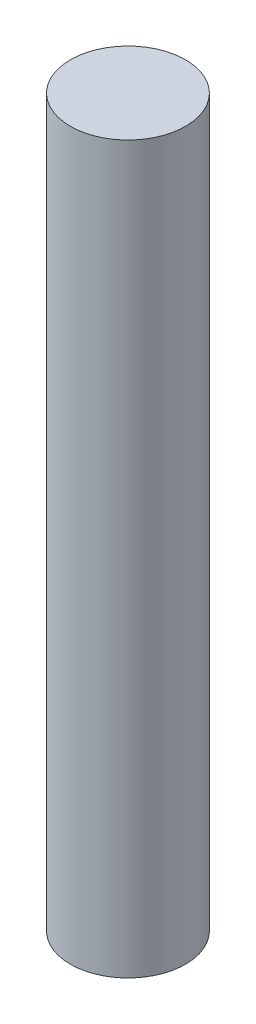
ISO-10303-21;
HEADER;
FILE_DESCRIPTION(('STEP AP214'),'2;1');
FILE_NAME('part.step','',(''),(''),'','','');
FILE_SCHEMA(('AUTOMOTIVE_DESIGN { 1 0 10303 214 1 1 1 1 }'));
ENDSEC;
DATA;
#1=APPLICATION_CONTEXT('core data for automotive mechanical design processes');
#2=APPLICATION_PROTOCOL_DEFINITION('international standard','automotive_design',2000,#1);
#3=PRODUCT_CONTEXT('',#1,'mechanical');
#4=PRODUCT('Part','Part','',(#3));
#5=PRODUCT_RELATED_PRODUCT_CATEGORY('part','',(#4));
#6=PRODUCT_DEFINITION_FORMATION('','',#4);
#7=PRODUCT_DEFINITION_CONTEXT('part definition',#1,'design');
#8=PRODUCT_DEFINITION('design','',#6,#7);
#9=PRODUCT_DEFINITION_SHAPE('','',#8);
#10=(LENGTH_UNIT() NAMED_UNIT(*) SI_UNIT(.MILLI.,.METRE.));
#11=(NAMED_UNIT(*) PLANE_ANGLE_UNIT() SI_UNIT($,.RADIAN.));
#12=(NAMED_UNIT(*) SI_UNIT($,.STERADIAN.) SOLID_ANGLE_UNIT());
#13=UNCERTAINTY_MEASURE_WITH_UNIT(LENGTH_MEASURE(1.E-05),#10,'distance_accuracy_value','');
#14=(GEOMETRIC_REPRESENTATION_CONTEXT(3) GLOBAL_UNCERTAINTY_ASSIGNED_CONTEXT((#13)) GLOBAL_UNIT_ASSIGNED_CONTEXT((#10,
#11,#12)) REPRESENTATION_CONTEXT('',''));
#15=CARTESIAN_POINT('',(0.,0.,0.));
#16=DIRECTION('',(0.,0.,1.));
#17=DIRECTION('',(1.,0.,0.));
#18=AXIS2_PLACEMENT_3D('',#15,#16,#17);
#19=CARTESIAN_POINT('',(0.,160.,0.));
#20=DIRECTION('',(0.,-1.,0.));
#21=DIRECTION('',(0.,0.,-1.));
#22=AXIS2_PLACEMENT_3D('',#19,#20,#21);
#23=CYLINDRICAL_SURFACE('',#22,12.7);
#24=CARTESIAN_POINT('',(0.,160.,0.));
#25=DIRECTION('',(0.,1.,0.));
#26=DIRECTION('',(0.,0.,1.));
#27=AXIS2_PLACEMENT_3D('',#24,#25,#26);
#28=CIRCLE('',#27,12.7);
#29=CARTESIAN_POINT('',(0.,160.,12.7));
#30=VERTEX_POINT('',#29);
#31=EDGE_CURVE('E10',#30,#30,#28,.T.);
#32=ORIENTED_EDGE('',*,*,#31,.F.);
#33=EDGE_LOOP('',(#32));
#34=FACE_BOUND('',#33,.T.);
#35=CARTESIAN_POINT('',(0.,0.,0.));
#36=DIRECTION('',(0.,1.,0.));
#37=DIRECTION('',(0.,0.,1.));
#38=AXIS2_PLACEMENT_3D('',#35,#36,#37);
#39=CIRCLE('',#38,12.7);
#40=CARTESIAN_POINT('',(0.,0.,12.7));
#41=VERTEX_POINT('',#40);
#42=EDGE_CURVE('E38',#41,#41,#39,.T.);
#43=ORIENTED_EDGE('',*,*,#42,.T.);
#44=EDGE_LOOP('',(#43));
#45=FACE_BOUND('',#44,.T.);
#46=ADVANCED_FACE('F35',(#34,#45),#23,.T.);
#47=CARTESIAN_POINT('',(0.,160.,0.));
#48=DIRECTION('',(0.,1.,0.));
#49=DIRECTION('',(0.,0.,1.));
#50=AXIS2_PLACEMENT_3D('',#47,#48,#49);
#51=PLANE('',#50);
#52=ORIENTED_EDGE('',*,*,#31,.T.);
#53=EDGE_LOOP('',(#52));
#54=FACE_BOUND('',#53,.T.);
#55=ADVANCED_FACE('F50',(#54),#51,.T.);
#56=CARTESIAN_POINT('',(0.,0.,0.));
#57=DIRECTION('',(0.,1.,0.));
#58=DIRECTION('',(0.,0.,1.));
#59=AXIS2_PLACEMENT_3D('',#56,#57,#58);
#60=PLANE('',#59);
#61=ORIENTED_EDGE('',*,*,#42,.F.);
#62=EDGE_LOOP('',(#61));
#63=FACE_BOUND('',#62,.T.);
#64=ADVANCED_FACE('F48',(#63),#60,.F.);
#65=CLOSED_SHELL('',(#46,#55,#64));
#66=MANIFOLD_SOLID_BREP('B2',#65);
#67=ADVANCED_BREP_SHAPE_REPRESENTATION('',(#18,#66),#14);
#68=SHAPE_DEFINITION_REPRESENTATION(#9,#67);
ENDSEC;
END-ISO-10303-21;
